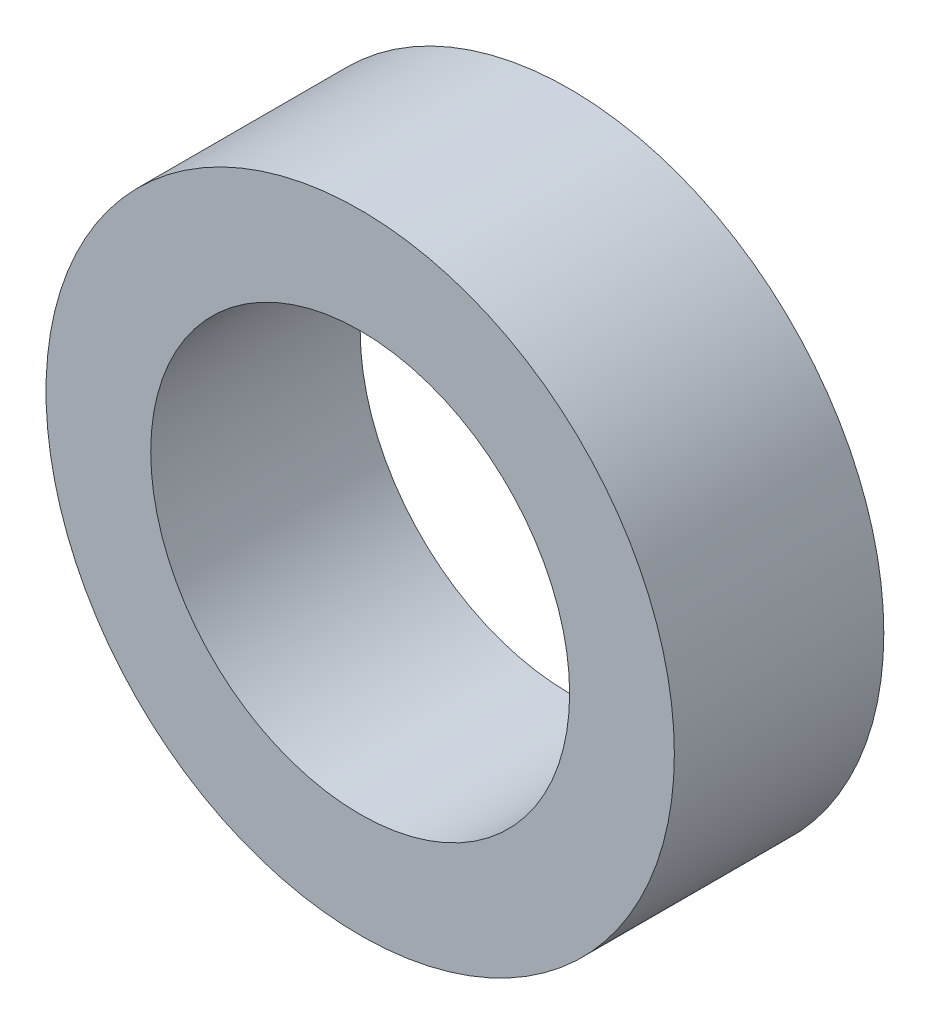
ISO-10303-21;
HEADER;
FILE_DESCRIPTION(('STEP AP214'),'2;1');
FILE_NAME('part.step','',(''),(''),'','','');
FILE_SCHEMA(('AUTOMOTIVE_DESIGN { 1 0 10303 214 1 1 1 1 }'));
ENDSEC;
DATA;
#1=APPLICATION_CONTEXT('core data for automotive mechanical design processes');
#2=APPLICATION_PROTOCOL_DEFINITION('international standard','automotive_design',2000,#1);
#3=PRODUCT_CONTEXT('',#1,'mechanical');
#4=PRODUCT('Part','Part','',(#3));
#5=PRODUCT_RELATED_PRODUCT_CATEGORY('part','',(#4));
#6=PRODUCT_DEFINITION_FORMATION('','',#4);
#7=PRODUCT_DEFINITION_CONTEXT('part definition',#1,'design');
#8=PRODUCT_DEFINITION('design','',#6,#7);
#9=PRODUCT_DEFINITION_SHAPE('','',#8);
#10=(LENGTH_UNIT() NAMED_UNIT(*) SI_UNIT(.MILLI.,.METRE.));
#11=(NAMED_UNIT(*) PLANE_ANGLE_UNIT() SI_UNIT($,.RADIAN.));
#12=(NAMED_UNIT(*) SI_UNIT($,.STERADIAN.) SOLID_ANGLE_UNIT());
#13=UNCERTAINTY_MEASURE_WITH_UNIT(LENGTH_MEASURE(1.E-05),#10,'distance_accuracy_value','');
#14=(GEOMETRIC_REPRESENTATION_CONTEXT(3) GLOBAL_UNCERTAINTY_ASSIGNED_CONTEXT((#13)) GLOBAL_UNIT_ASSIGNED_CONTEXT((#10,
#11,#12)) REPRESENTATION_CONTEXT('',''));
#15=CARTESIAN_POINT('',(0.,0.,0.));
#16=DIRECTION('',(0.,0.,1.));
#17=DIRECTION('',(1.,0.,0.));
#18=AXIS2_PLACEMENT_3D('',#15,#16,#17);
#19=CARTESIAN_POINT('',(0.,0.,5.));
#20=DIRECTION('',(0.,0.,1.));
#21=DIRECTION('',(1.,0.,0.));
#22=AXIS2_PLACEMENT_3D('',#19,#20,#21);
#23=PLANE('',#22);
#24=CARTESIAN_POINT('',(0.,0.,5.));
#25=DIRECTION('',(0.,0.,1.));
#26=DIRECTION('',(1.,0.,0.));
#27=AXIS2_PLACEMENT_3D('',#24,#25,#26);
#28=CIRCLE('',#27,7.5);
#29=CARTESIAN_POINT('',(7.5,0.,5.));
#30=VERTEX_POINT('',#29);
#31=EDGE_CURVE('E10',#30,#30,#28,.T.);
#32=ORIENTED_EDGE('',*,*,#31,.T.);
#33=EDGE_LOOP('',(#32));
#34=FACE_BOUND('',#33,.T.);
#35=CARTESIAN_POINT('',(0.,0.,5.));
#36=DIRECTION('',(0.,0.,1.));
#37=DIRECTION('',(1.,0.,0.));
#38=AXIS2_PLACEMENT_3D('',#35,#36,#37);
#39=CIRCLE('',#38,5.);
#40=CARTESIAN_POINT('',(5.,0.,5.));
#41=VERTEX_POINT('',#40);
#42=EDGE_CURVE('E45',#41,#41,#39,.T.);
#43=ORIENTED_EDGE('',*,*,#42,.F.);
#44=EDGE_LOOP('',(#43));
#45=FACE_BOUND('',#44,.T.);
#46=ADVANCED_FACE('F34',(#34,#45),#23,.T.);
#47=CARTESIAN_POINT('',(0.,0.,0.));
#48=DIRECTION('',(0.,0.,1.));
#49=DIRECTION('',(1.,0.,0.));
#50=AXIS2_PLACEMENT_3D('',#47,#48,#49);
#51=PLANE('',#50);
#52=CARTESIAN_POINT('',(0.,0.,0.));
#53=DIRECTION('',(0.,0.,1.));
#54=DIRECTION('',(1.,0.,0.));
#55=AXIS2_PLACEMENT_3D('',#52,#53,#54);
#56=CIRCLE('',#55,7.5);
#57=CARTESIAN_POINT('',(7.5,0.,0.));
#58=VERTEX_POINT('',#57);
#59=EDGE_CURVE('E38',#58,#58,#56,.T.);
#60=ORIENTED_EDGE('',*,*,#59,.F.);
#61=EDGE_LOOP('',(#60));
#62=FACE_BOUND('',#61,.T.);
#63=CARTESIAN_POINT('',(0.,0.,0.));
#64=DIRECTION('',(0.,0.,1.));
#65=DIRECTION('',(1.,0.,0.));
#66=AXIS2_PLACEMENT_3D('',#63,#64,#65);
#67=CIRCLE('',#66,5.);
#68=CARTESIAN_POINT('',(5.,0.,0.));
#69=VERTEX_POINT('',#68);
#70=EDGE_CURVE('E47',#69,#69,#67,.T.);
#71=ORIENTED_EDGE('',*,*,#70,.T.);
#72=EDGE_LOOP('',(#71));
#73=FACE_BOUND('',#72,.T.);
#74=ADVANCED_FACE('F57',(#62,#73),#51,.F.);
#75=CARTESIAN_POINT('',(0.,0.,5.));
#76=DIRECTION('',(0.,0.,-1.));
#77=DIRECTION('',(-1.,0.,0.));
#78=AXIS2_PLACEMENT_3D('',#75,#76,#77);
#79=CYLINDRICAL_SURFACE('',#78,7.5);
#80=ORIENTED_EDGE('',*,*,#31,.F.);
#81=EDGE_LOOP('',(#80));
#82=FACE_BOUND('',#81,.T.);
#83=ORIENTED_EDGE('',*,*,#59,.T.);
#84=EDGE_LOOP('',(#83));
#85=FACE_BOUND('',#84,.T.);
#86=ADVANCED_FACE('F36',(#82,#85),#79,.T.);
#87=CARTESIAN_POINT('',(0.,0.,5.));
#88=DIRECTION('',(0.,0.,-1.));
#89=DIRECTION('',(-1.,0.,0.));
#90=AXIS2_PLACEMENT_3D('',#87,#88,#89);
#91=CYLINDRICAL_SURFACE('',#90,5.);
#92=ORIENTED_EDGE('',*,*,#42,.T.);
#93=EDGE_LOOP('',(#92));
#94=FACE_BOUND('',#93,.T.);
#95=ORIENTED_EDGE('',*,*,#70,.F.);
#96=EDGE_LOOP('',(#95));
#97=FACE_BOUND('',#96,.T.);
#98=ADVANCED_FACE('F53',(#94,#97),#91,.F.);
#99=CLOSED_SHELL('',(#46,#74,#86,#98));
#100=MANIFOLD_SOLID_BREP('B2',#99);
#101=ADVANCED_BREP_SHAPE_REPRESENTATION('',(#18,#100),#14);
#102=SHAPE_DEFINITION_REPRESENTATION(#9,#101);
ENDSEC;
END-ISO-10303-21;
